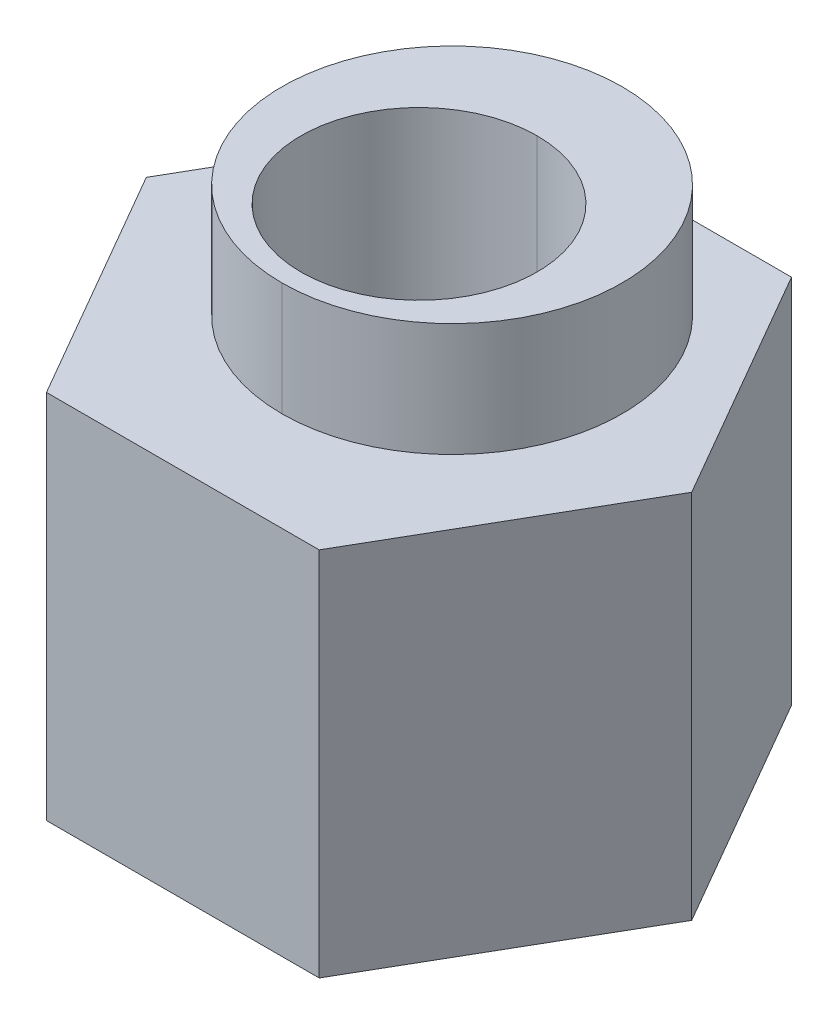
ISO-10303-21;
HEADER;
FILE_DESCRIPTION(('STEP AP214'),'2;1');
FILE_NAME('part.step','',(''),(''),'','','');
FILE_SCHEMA(('AUTOMOTIVE_DESIGN { 1 0 10303 214 1 1 1 1 }'));
ENDSEC;
DATA;
#1=APPLICATION_CONTEXT('core data for automotive mechanical design processes');
#2=APPLICATION_PROTOCOL_DEFINITION('international standard','automotive_design',2000,#1);
#3=PRODUCT_CONTEXT('',#1,'mechanical');
#4=PRODUCT('Part','Part','',(#3));
#5=PRODUCT_RELATED_PRODUCT_CATEGORY('part','',(#4));
#6=PRODUCT_DEFINITION_FORMATION('','',#4);
#7=PRODUCT_DEFINITION_CONTEXT('part definition',#1,'design');
#8=PRODUCT_DEFINITION('design','',#6,#7);
#9=PRODUCT_DEFINITION_SHAPE('','',#8);
#10=(LENGTH_UNIT() NAMED_UNIT(*) SI_UNIT(.MILLI.,.METRE.));
#11=(NAMED_UNIT(*) PLANE_ANGLE_UNIT() SI_UNIT($,.RADIAN.));
#12=(NAMED_UNIT(*) SI_UNIT($,.STERADIAN.) SOLID_ANGLE_UNIT());
#13=UNCERTAINTY_MEASURE_WITH_UNIT(LENGTH_MEASURE(1.E-05),#10,'distance_accuracy_value','');
#14=(GEOMETRIC_REPRESENTATION_CONTEXT(3) GLOBAL_UNCERTAINTY_ASSIGNED_CONTEXT((#13)) GLOBAL_UNIT_ASSIGNED_CONTEXT((#10,
#11,#12)) REPRESENTATION_CONTEXT('',''));
#15=CARTESIAN_POINT('',(0.,0.,0.));
#16=DIRECTION('',(0.,0.,1.));
#17=DIRECTION('',(1.,0.,0.));
#18=AXIS2_PLACEMENT_3D('',#15,#16,#17);
#19=CARTESIAN_POINT('',(0.,-0.5,0.));
#20=DIRECTION('',(0.,1.,0.));
#21=DIRECTION('',(0.,0.,1.));
#22=AXIS2_PLACEMENT_3D('',#19,#20,#21);
#23=CONICAL_SURFACE('',#22,3.5,0.785398163397448);
#24=DIRECTION('',(0.,0.707106781186548,-0.707106781186548));
#25=VECTOR('',#24,1.);
#26=CARTESIAN_POINT('',(0.,-0.5,-3.5));
#27=LINE('',#26,#25);
#28=CARTESIAN_POINT('',(0.,-0.5,-3.5));
#29=VERTEX_POINT('',#28);
#30=CARTESIAN_POINT('',(0.,-0.4,-3.6));
#31=VERTEX_POINT('',#30);
#32=EDGE_CURVE('E272',#29,#31,#27,.T.);
#33=ORIENTED_EDGE('',*,*,#32,.F.);
#34=CARTESIAN_POINT('',(0.,-0.5,0.));
#35=DIRECTION('',(0.,-1.,0.));
#36=DIRECTION('',(0.,0.,-1.));
#37=AXIS2_PLACEMENT_3D('',#34,#35,#36);
#38=CIRCLE('',#37,3.5);
#39=CARTESIAN_POINT('',(0.,-0.5,3.5));
#40=VERTEX_POINT('',#39);
#41=EDGE_CURVE('E235',#40,#29,#38,.T.);
#42=ORIENTED_EDGE('',*,*,#41,.F.);
#43=DIRECTION('',(0.,0.707106781186548,0.707106781186548));
#44=VECTOR('',#43,1.);
#45=CARTESIAN_POINT('',(0.,-0.5,3.5));
#46=LINE('',#45,#44);
#47=CARTESIAN_POINT('',(0.,-0.4,3.6));
#48=VERTEX_POINT('',#47);
#49=EDGE_CURVE('E287',#40,#48,#46,.T.);
#50=ORIENTED_EDGE('',*,*,#49,.T.);
#51=CARTESIAN_POINT('',(0.,-0.4,0.));
#52=DIRECTION('',(0.,1.,0.));
#53=DIRECTION('',(0.,0.,-1.));
#54=AXIS2_PLACEMENT_3D('',#51,#52,#53);
#55=CIRCLE('',#54,3.6);
#56=EDGE_CURVE('E254',#31,#48,#55,.T.);
#57=ORIENTED_EDGE('',*,*,#56,.F.);
#58=EDGE_LOOP('',(#33,#42,#50,#57));
#59=FACE_BOUND('',#58,.T.);
#60=ADVANCED_FACE('F17',(#59),#23,.T.);
#61=CARTESIAN_POINT('',(0.,10.25,0.));
#62=DIRECTION('',(0.,-1.,0.));
#63=DIRECTION('',(0.,0.,-1.));
#64=AXIS2_PLACEMENT_3D('',#61,#62,#63);
#65=CYLINDRICAL_SURFACE('',#64,2.5);
#66=DIRECTION('',(0.,-1.,0.));
#67=VECTOR('',#66,1.);
#68=CARTESIAN_POINT('',(0.,10.25,2.5));
#69=LINE('',#68,#67);
#70=CARTESIAN_POINT('',(0.,10.25,2.5));
#71=VERTEX_POINT('',#70);
#72=CARTESIAN_POINT('',(0.,-0.5,2.5));
#73=VERTEX_POINT('',#72);
#74=EDGE_CURVE('E283',#71,#73,#69,.T.);
#75=ORIENTED_EDGE('',*,*,#74,.F.);
#76=CARTESIAN_POINT('',(0.,10.25,0.));
#77=DIRECTION('',(0.,-1.,0.));
#78=DIRECTION('',(0.,0.,-1.));
#79=AXIS2_PLACEMENT_3D('',#76,#77,#78);
#80=CIRCLE('',#79,2.5);
#81=CARTESIAN_POINT('',(0.,10.25,-2.5));
#82=VERTEX_POINT('',#81);
#83=EDGE_CURVE('E11',#82,#71,#80,.T.);
#84=ORIENTED_EDGE('',*,*,#83,.F.);
#85=DIRECTION('',(0.,-1.,0.));
#86=VECTOR('',#85,1.);
#87=CARTESIAN_POINT('',(0.,10.25,-2.5));
#88=LINE('',#87,#86);
#89=CARTESIAN_POINT('',(0.,-0.5,-2.5));
#90=VERTEX_POINT('',#89);
#91=EDGE_CURVE('E282',#82,#90,#88,.T.);
#92=ORIENTED_EDGE('',*,*,#91,.T.);
#93=CARTESIAN_POINT('',(0.,-0.5,0.));
#94=DIRECTION('',(0.,-1.,0.));
#95=DIRECTION('',(0.,0.,-1.));
#96=AXIS2_PLACEMENT_3D('',#93,#94,#95);
#97=CIRCLE('',#96,2.5);
#98=EDGE_CURVE('E222',#90,#73,#97,.T.);
#99=ORIENTED_EDGE('',*,*,#98,.T.);
#100=EDGE_LOOP('',(#75,#84,#92,#99));
#101=FACE_BOUND('',#100,.T.);
#102=ADVANCED_FACE('F309',(#101),#65,.F.);
#103=CARTESIAN_POINT('',(0.,10.25,-0.7));
#104=DIRECTION('',(0.,1.,0.));
#105=DIRECTION('',(1.,0.,0.));
#106=AXIS2_PLACEMENT_3D('',#103,#104,#105);
#107=PLANE('',#106);
#108=ORIENTED_EDGE('',*,*,#83,.T.);
#109=CARTESIAN_POINT('',(0.,10.25,0.));
#110=DIRECTION('',(0.,-1.,0.));
#111=DIRECTION('',(0.,0.,-1.));
#112=AXIS2_PLACEMENT_3D('',#109,#110,#111);
#113=CIRCLE('',#112,2.5);
#114=EDGE_CURVE('E291',#71,#82,#113,.T.);
#115=ORIENTED_EDGE('',*,*,#114,.T.);
#116=EDGE_LOOP('',(#108,#115));
#117=FACE_BOUND('',#116,.T.);
#118=CARTESIAN_POINT('',(0.,10.25,-0.7));
#119=DIRECTION('',(0.,1.,0.));
#120=DIRECTION('',(0.,0.,1.));
#121=AXIS2_PLACEMENT_3D('',#118,#119,#120);
#122=CIRCLE('',#121,3.6);
#123=CARTESIAN_POINT('',(0.,10.25,-4.3));
#124=VERTEX_POINT('',#123);
#125=CARTESIAN_POINT('',(0.,10.25,2.9));
#126=VERTEX_POINT('',#125);
#127=EDGE_CURVE('E25',#124,#126,#122,.T.);
#128=ORIENTED_EDGE('',*,*,#127,.T.);
#129=CARTESIAN_POINT('',(0.,10.25,-0.7));
#130=DIRECTION('',(0.,1.,0.));
#131=DIRECTION('',(0.,0.,1.));
#132=AXIS2_PLACEMENT_3D('',#129,#130,#131);
#133=CIRCLE('',#132,3.6);
#134=EDGE_CURVE('E174',#126,#124,#133,.T.);
#135=ORIENTED_EDGE('',*,*,#134,.T.);
#136=EDGE_LOOP('',(#128,#135));
#137=FACE_BOUND('',#136,.T.);
#138=ADVANCED_FACE('F307',(#117,#137),#107,.T.);
#139=CARTESIAN_POINT('',(0.,10.25,-0.7));
#140=DIRECTION('',(0.,-1.,0.));
#141=DIRECTION('',(0.,0.,-1.));
#142=AXIS2_PLACEMENT_3D('',#139,#140,#141);
#143=CYLINDRICAL_SURFACE('',#142,3.6);
#144=DIRECTION('',(0.,-1.,0.));
#145=VECTOR('',#144,1.);
#146=CARTESIAN_POINT('',(0.,10.25,2.9));
#147=LINE('',#146,#145);
#148=CARTESIAN_POINT('',(0.,7.85,2.9));
#149=VERTEX_POINT('',#148);
#150=EDGE_CURVE('E167',#126,#149,#147,.T.);
#151=ORIENTED_EDGE('',*,*,#150,.F.);
#152=ORIENTED_EDGE('',*,*,#127,.F.);
#153=DIRECTION('',(0.,-1.,0.));
#154=VECTOR('',#153,1.);
#155=CARTESIAN_POINT('',(0.,10.25,-4.3));
#156=LINE('',#155,#154);
#157=CARTESIAN_POINT('',(0.,7.85,-4.3));
#158=VERTEX_POINT('',#157);
#159=EDGE_CURVE('E158',#124,#158,#156,.T.);
#160=ORIENTED_EDGE('',*,*,#159,.T.);
#161=CARTESIAN_POINT('',(0.,7.85,-0.7));
#162=DIRECTION('',(0.,1.,0.));
#163=DIRECTION('',(0.,0.,1.));
#164=AXIS2_PLACEMENT_3D('',#161,#162,#163);
#165=CIRCLE('',#164,3.6);
#166=EDGE_CURVE('E145',#158,#149,#165,.T.);
#167=ORIENTED_EDGE('',*,*,#166,.T.);
#168=EDGE_LOOP('',(#151,#152,#160,#167));
#169=FACE_BOUND('',#168,.T.);
#170=ADVANCED_FACE('F159',(#169),#143,.T.);
#171=CARTESIAN_POINT('',(0.,-0.5,0.));
#172=DIRECTION('',(0.,-1.,0.));
#173=DIRECTION('',(0.,0.,-1.));
#174=AXIS2_PLACEMENT_3D('',#171,#172,#173);
#175=PLANE('',#174);
#176=ORIENTED_EDGE('',*,*,#98,.F.);
#177=CARTESIAN_POINT('',(0.,-0.5,0.));
#178=DIRECTION('',(0.,-1.,0.));
#179=DIRECTION('',(0.,0.,-1.));
#180=AXIS2_PLACEMENT_3D('',#177,#178,#179);
#181=CIRCLE('',#180,2.5);
#182=EDGE_CURVE('E278',#73,#90,#181,.T.);
#183=ORIENTED_EDGE('',*,*,#182,.F.);
#184=EDGE_LOOP('',(#176,#183));
#185=FACE_BOUND('',#184,.T.);
#186=ORIENTED_EDGE('',*,*,#41,.T.);
#187=CARTESIAN_POINT('',(0.,-0.5,0.));
#188=DIRECTION('',(0.,-1.,0.));
#189=DIRECTION('',(0.,0.,-1.));
#190=AXIS2_PLACEMENT_3D('',#187,#188,#189);
#191=CIRCLE('',#190,3.5);
#192=EDGE_CURVE('E277',#29,#40,#191,.T.);
#193=ORIENTED_EDGE('',*,*,#192,.T.);
#194=EDGE_LOOP('',(#186,#193));
#195=FACE_BOUND('',#194,.T.);
#196=ADVANCED_FACE('F317',(#185,#195),#175,.T.);
#197=CARTESIAN_POINT('',(0.,-0.5,0.));
#198=DIRECTION('',(0.,1.,0.));
#199=DIRECTION('',(0.,0.,1.));
#200=AXIS2_PLACEMENT_3D('',#197,#198,#199);
#201=CYLINDRICAL_SURFACE('',#200,3.6);
#202=DIRECTION('',(0.,1.,0.));
#203=VECTOR('',#202,1.);
#204=CARTESIAN_POINT('',(0.,-0.5,-3.6));
#205=LINE('',#204,#203);
#206=CARTESIAN_POINT('',(0.,0.,-3.6));
#207=VERTEX_POINT('',#206);
#208=EDGE_CURVE('E164',#31,#207,#205,.T.);
#209=ORIENTED_EDGE('',*,*,#208,.F.);
#210=ORIENTED_EDGE('',*,*,#56,.T.);
#211=DIRECTION('',(0.,1.,0.));
#212=VECTOR('',#211,1.);
#213=CARTESIAN_POINT('',(0.,-0.5,3.6));
#214=LINE('',#213,#212);
#215=CARTESIAN_POINT('',(0.,0.,3.6));
#216=VERTEX_POINT('',#215);
#217=EDGE_CURVE('E178',#48,#216,#214,.T.);
#218=ORIENTED_EDGE('',*,*,#217,.T.);
#219=CARTESIAN_POINT('',(0.,0.,0.));
#220=DIRECTION('',(0.,-1.,0.));
#221=DIRECTION('',(0.,0.,-1.));
#222=AXIS2_PLACEMENT_3D('',#219,#220,#221);
#223=CIRCLE('',#222,3.6);
#224=EDGE_CURVE('E155',#216,#207,#223,.T.);
#225=ORIENTED_EDGE('',*,*,#224,.T.);
#226=EDGE_LOOP('',(#209,#210,#218,#225));
#227=FACE_BOUND('',#226,.T.);
#228=ADVANCED_FACE('F558',(#227),#201,.T.);
#229=CARTESIAN_POINT('',(0.,0.,0.));
#230=DIRECTION('',(0.,1.,0.));
#231=DIRECTION('',(1.,0.,0.));
#232=AXIS2_PLACEMENT_3D('',#229,#230,#231);
#233=PLANE('',#232);
#234=ORIENTED_EDGE('',*,*,#224,.F.);
#235=CARTESIAN_POINT('',(0.,0.,0.));
#236=DIRECTION('',(0.,-1.,0.));
#237=DIRECTION('',(0.,0.,-1.));
#238=AXIS2_PLACEMENT_3D('',#235,#236,#237);
#239=CIRCLE('',#238,3.6);
#240=EDGE_CURVE('E186',#207,#216,#239,.T.);
#241=ORIENTED_EDGE('',*,*,#240,.F.);
#242=EDGE_LOOP('',(#234,#241));
#243=FACE_BOUND('',#242,.T.);
#244=DIRECTION('',(-0.5,0.,0.866025403784439));
#245=VECTOR('',#244,1.);
#246=CARTESIAN_POINT('',(-2.88675134594813,0.,-5.));
#247=LINE('',#246,#245);
#248=CARTESIAN_POINT('',(-2.88675134594813,0.,-5.));
#249=VERTEX_POINT('',#248);
#250=CARTESIAN_POINT('',(-5.77350269189626,0.,0.));
#251=VERTEX_POINT('',#250);
#252=EDGE_CURVE('E195',#249,#251,#247,.T.);
#253=ORIENTED_EDGE('',*,*,#252,.F.);
#254=DIRECTION('',(-1.,0.,0.));
#255=VECTOR('',#254,1.);
#256=CARTESIAN_POINT('',(2.88675134594813,0.,-5.));
#257=LINE('',#256,#255);
#258=CARTESIAN_POINT('',(2.88675134594813,0.,-5.));
#259=VERTEX_POINT('',#258);
#260=EDGE_CURVE('E49',#259,#249,#257,.T.);
#261=ORIENTED_EDGE('',*,*,#260,.F.);
#262=DIRECTION('',(-0.5,0.,-0.866025403784439));
#263=VECTOR('',#262,1.);
#264=CARTESIAN_POINT('',(5.77350269189626,0.,0.));
#265=LINE('',#264,#263);
#266=CARTESIAN_POINT('',(5.77350269189626,0.,0.));
#267=VERTEX_POINT('',#266);
#268=EDGE_CURVE('E239',#267,#259,#265,.T.);
#269=ORIENTED_EDGE('',*,*,#268,.F.);
#270=DIRECTION('',(0.5,0.,-0.866025403784439));
#271=VECTOR('',#270,1.);
#272=CARTESIAN_POINT('',(2.88675134594813,0.,5.));
#273=LINE('',#272,#271);
#274=CARTESIAN_POINT('',(2.88675134594813,0.,5.));
#275=VERTEX_POINT('',#274);
#276=EDGE_CURVE('E180',#275,#267,#273,.T.);
#277=ORIENTED_EDGE('',*,*,#276,.F.);
#278=DIRECTION('',(1.,0.,0.));
#279=VECTOR('',#278,1.);
#280=CARTESIAN_POINT('',(-2.88675134594813,0.,5.));
#281=LINE('',#280,#279);
#282=CARTESIAN_POINT('',(-2.88675134594813,0.,5.));
#283=VERTEX_POINT('',#282);
#284=EDGE_CURVE('E215',#283,#275,#281,.T.);
#285=ORIENTED_EDGE('',*,*,#284,.F.);
#286=DIRECTION('',(0.5,0.,0.866025403784439));
#287=VECTOR('',#286,1.);
#288=CARTESIAN_POINT('',(-5.77350269189626,0.,0.));
#289=LINE('',#288,#287);
#290=EDGE_CURVE('E203',#251,#283,#289,.T.);
#291=ORIENTED_EDGE('',*,*,#290,.F.);
#292=EDGE_LOOP('',(#253,#261,#269,#277,#285,#291));
#293=FACE_BOUND('',#292,.T.);
#294=ADVANCED_FACE('F554',(#243,#293),#233,.F.);
#295=CARTESIAN_POINT('',(0.,7.85,0.));
#296=DIRECTION('',(0.,1.,0.));
#297=DIRECTION('',(1.,0.,0.));
#298=AXIS2_PLACEMENT_3D('',#295,#296,#297);
#299=PLANE('',#298);
#300=ORIENTED_EDGE('',*,*,#166,.F.);
#301=CARTESIAN_POINT('',(0.,7.85,-0.7));
#302=DIRECTION('',(0.,1.,0.));
#303=DIRECTION('',(0.,0.,1.));
#304=AXIS2_PLACEMENT_3D('',#301,#302,#303);
#305=CIRCLE('',#304,3.6);
#306=EDGE_CURVE('E150',#149,#158,#305,.T.);
#307=ORIENTED_EDGE('',*,*,#306,.F.);
#308=EDGE_LOOP('',(#300,#307));
#309=FACE_BOUND('',#308,.T.);
#310=DIRECTION('',(-0.5,0.,0.866025403784439));
#311=VECTOR('',#310,1.);
#312=CARTESIAN_POINT('',(-2.88675134594813,7.85,-5.));
#313=LINE('',#312,#311);
#314=CARTESIAN_POINT('',(-2.88675134594813,7.85,-5.));
#315=VERTEX_POINT('',#314);
#316=CARTESIAN_POINT('',(-5.77350269189626,7.85,0.));
#317=VERTEX_POINT('',#316);
#318=EDGE_CURVE('E194',#315,#317,#313,.T.);
#319=ORIENTED_EDGE('',*,*,#318,.T.);
#320=DIRECTION('',(0.5,0.,0.866025403784439));
#321=VECTOR('',#320,1.);
#322=CARTESIAN_POINT('',(-5.77350269189626,7.85,0.));
#323=LINE('',#322,#321);
#324=CARTESIAN_POINT('',(-2.88675134594813,7.85,5.));
#325=VERTEX_POINT('',#324);
#326=EDGE_CURVE('E211',#317,#325,#323,.T.);
#327=ORIENTED_EDGE('',*,*,#326,.T.);
#328=DIRECTION('',(1.,0.,0.));
#329=VECTOR('',#328,1.);
#330=CARTESIAN_POINT('',(-2.88675134594813,7.85,5.));
#331=LINE('',#330,#329);
#332=CARTESIAN_POINT('',(2.88675134594813,7.85,5.));
#333=VERTEX_POINT('',#332);
#334=EDGE_CURVE('E184',#325,#333,#331,.T.);
#335=ORIENTED_EDGE('',*,*,#334,.T.);
#336=DIRECTION('',(0.5,0.,-0.866025403784439));
#337=VECTOR('',#336,1.);
#338=CARTESIAN_POINT('',(2.88675134594813,7.85,5.));
#339=LINE('',#338,#337);
#340=CARTESIAN_POINT('',(5.77350269189626,7.85,0.));
#341=VERTEX_POINT('',#340);
#342=EDGE_CURVE('E232',#333,#341,#339,.T.);
#343=ORIENTED_EDGE('',*,*,#342,.T.);
#344=DIRECTION('',(-0.5,0.,-0.866025403784439));
#345=VECTOR('',#344,1.);
#346=CARTESIAN_POINT('',(5.77350269189626,7.85,0.));
#347=LINE('',#346,#345);
#348=CARTESIAN_POINT('',(2.88675134594813,7.85,-5.));
#349=VERTEX_POINT('',#348);
#350=EDGE_CURVE('E246',#341,#349,#347,.T.);
#351=ORIENTED_EDGE('',*,*,#350,.T.);
#352=DIRECTION('',(-1.,0.,0.));
#353=VECTOR('',#352,1.);
#354=CARTESIAN_POINT('',(2.88675134594813,7.85,-5.));
#355=LINE('',#354,#353);
#356=EDGE_CURVE('E38',#349,#315,#355,.T.);
#357=ORIENTED_EDGE('',*,*,#356,.T.);
#358=EDGE_LOOP('',(#319,#327,#335,#343,#351,#357));
#359=FACE_BOUND('',#358,.T.);
#360=ADVANCED_FACE('F147',(#309,#359),#299,.T.);
#361=CARTESIAN_POINT('',(2.88675134594813,7.85,-5.));
#362=DIRECTION('',(0.,0.,1.));
#363=DIRECTION('',(1.,0.,0.));
#364=AXIS2_PLACEMENT_3D('',#361,#362,#363);
#365=PLANE('',#364);
#366=ORIENTED_EDGE('',*,*,#260,.T.);
#367=DIRECTION('',(0.,-1.,0.));
#368=VECTOR('',#367,1.);
#369=CARTESIAN_POINT('',(-2.88675134594813,7.85,-5.));
#370=LINE('',#369,#368);
#371=EDGE_CURVE('E199',#315,#249,#370,.T.);
#372=ORIENTED_EDGE('',*,*,#371,.F.);
#373=ORIENTED_EDGE('',*,*,#356,.F.);
#374=DIRECTION('',(0.,-1.,0.));
#375=VECTOR('',#374,1.);
#376=CARTESIAN_POINT('',(2.88675134594813,7.85,-5.));
#377=LINE('',#376,#375);
#378=EDGE_CURVE('E243',#349,#259,#377,.T.);
#379=ORIENTED_EDGE('',*,*,#378,.T.);
#380=EDGE_LOOP('',(#366,#372,#373,#379));
#381=FACE_BOUND('',#380,.T.);
#382=ADVANCED_FACE('F573',(#381),#365,.F.);
#383=CARTESIAN_POINT('',(5.77350269189626,7.85,0.));
#384=DIRECTION('',(-0.866025403784439,0.,0.5));
#385=DIRECTION('',(0.,1.,0.));
#386=AXIS2_PLACEMENT_3D('',#383,#384,#385);
#387=PLANE('',#386);
#388=ORIENTED_EDGE('',*,*,#268,.T.);
#389=ORIENTED_EDGE('',*,*,#378,.F.);
#390=ORIENTED_EDGE('',*,*,#350,.F.);
#391=DIRECTION('',(0.,-1.,0.));
#392=VECTOR('',#391,1.);
#393=CARTESIAN_POINT('',(5.77350269189626,7.85,0.));
#394=LINE('',#393,#392);
#395=EDGE_CURVE('E183',#341,#267,#394,.T.);
#396=ORIENTED_EDGE('',*,*,#395,.T.);
#397=EDGE_LOOP('',(#388,#389,#390,#396));
#398=FACE_BOUND('',#397,.T.);
#399=ADVANCED_FACE('F567',(#398),#387,.F.);
#400=CARTESIAN_POINT('',(2.88675134594813,7.85,5.));
#401=DIRECTION('',(-0.866025403784439,0.,-0.5));
#402=DIRECTION('',(-0.5,0.,0.866025403784439));
#403=AXIS2_PLACEMENT_3D('',#400,#401,#402);
#404=PLANE('',#403);
#405=ORIENTED_EDGE('',*,*,#276,.T.);
#406=ORIENTED_EDGE('',*,*,#395,.F.);
#407=ORIENTED_EDGE('',*,*,#342,.F.);
#408=DIRECTION('',(0.,-1.,0.));
#409=VECTOR('',#408,1.);
#410=CARTESIAN_POINT('',(2.88675134594813,7.85,5.));
#411=LINE('',#410,#409);
#412=EDGE_CURVE('E219',#333,#275,#411,.T.);
#413=ORIENTED_EDGE('',*,*,#412,.T.);
#414=EDGE_LOOP('',(#405,#406,#407,#413));
#415=FACE_BOUND('',#414,.T.);
#416=ADVANCED_FACE('F499',(#415),#404,.F.);
#417=CARTESIAN_POINT('',(-2.88675134594813,7.85,5.));
#418=DIRECTION('',(0.,0.,-1.));
#419=DIRECTION('',(-1.,0.,0.));
#420=AXIS2_PLACEMENT_3D('',#417,#418,#419);
#421=PLANE('',#420);
#422=ORIENTED_EDGE('',*,*,#284,.T.);
#423=ORIENTED_EDGE('',*,*,#412,.F.);
#424=ORIENTED_EDGE('',*,*,#334,.F.);
#425=DIRECTION('',(0.,-1.,0.));
#426=VECTOR('',#425,1.);
#427=CARTESIAN_POINT('',(-2.88675134594813,7.85,5.));
#428=LINE('',#427,#426);
#429=EDGE_CURVE('E207',#325,#283,#428,.T.);
#430=ORIENTED_EDGE('',*,*,#429,.T.);
#431=EDGE_LOOP('',(#422,#423,#424,#430));
#432=FACE_BOUND('',#431,.T.);
#433=ADVANCED_FACE('F494',(#432),#421,.F.);
#434=CARTESIAN_POINT('',(-5.77350269189626,7.85,0.));
#435=DIRECTION('',(0.866025403784439,0.,-0.5));
#436=DIRECTION('',(0.,-1.,0.));
#437=AXIS2_PLACEMENT_3D('',#434,#435,#436);
#438=PLANE('',#437);
#439=ORIENTED_EDGE('',*,*,#290,.T.);
#440=ORIENTED_EDGE('',*,*,#429,.F.);
#441=ORIENTED_EDGE('',*,*,#326,.F.);
#442=DIRECTION('',(0.,-1.,0.));
#443=VECTOR('',#442,1.);
#444=CARTESIAN_POINT('',(-5.77350269189626,7.85,0.));
#445=LINE('',#444,#443);
#446=EDGE_CURVE('E190',#317,#251,#445,.T.);
#447=ORIENTED_EDGE('',*,*,#446,.T.);
#448=EDGE_LOOP('',(#439,#440,#441,#447));
#449=FACE_BOUND('',#448,.T.);
#450=ADVANCED_FACE('F498',(#449),#438,.F.);
#451=CARTESIAN_POINT('',(-2.88675134594813,7.85,-5.));
#452=DIRECTION('',(0.866025403784439,0.,0.5));
#453=DIRECTION('',(0.,-1.,0.));
#454=AXIS2_PLACEMENT_3D('',#451,#452,#453);
#455=PLANE('',#454);
#456=ORIENTED_EDGE('',*,*,#252,.T.);
#457=ORIENTED_EDGE('',*,*,#446,.F.);
#458=ORIENTED_EDGE('',*,*,#318,.F.);
#459=ORIENTED_EDGE('',*,*,#371,.T.);
#460=EDGE_LOOP('',(#456,#457,#458,#459));
#461=FACE_BOUND('',#460,.T.);
#462=ADVANCED_FACE('F516',(#461),#455,.F.);
#463=CARTESIAN_POINT('',(0.,-0.5,0.));
#464=DIRECTION('',(0.,1.,0.));
#465=DIRECTION('',(0.,0.,1.));
#466=AXIS2_PLACEMENT_3D('',#463,#464,#465);
#467=CYLINDRICAL_SURFACE('',#466,3.6);
#468=CARTESIAN_POINT('',(0.,-0.4,0.));
#469=DIRECTION('',(0.,1.,0.));
#470=DIRECTION('',(0.,0.,-1.));
#471=AXIS2_PLACEMENT_3D('',#468,#469,#470);
#472=CIRCLE('',#471,3.6);
#473=EDGE_CURVE('E276',#48,#31,#472,.T.);
#474=ORIENTED_EDGE('',*,*,#473,.T.);
#475=ORIENTED_EDGE('',*,*,#208,.T.);
#476=ORIENTED_EDGE('',*,*,#240,.T.);
#477=ORIENTED_EDGE('',*,*,#217,.F.);
#478=EDGE_LOOP('',(#474,#475,#476,#477));
#479=FACE_BOUND('',#478,.T.);
#480=ADVANCED_FACE('F525',(#479),#467,.T.);
#481=CARTESIAN_POINT('',(0.,10.25,-0.7));
#482=DIRECTION('',(0.,-1.,0.));
#483=DIRECTION('',(0.,0.,-1.));
#484=AXIS2_PLACEMENT_3D('',#481,#482,#483);
#485=CYLINDRICAL_SURFACE('',#484,3.6);
#486=ORIENTED_EDGE('',*,*,#134,.F.);
#487=ORIENTED_EDGE('',*,*,#150,.T.);
#488=ORIENTED_EDGE('',*,*,#306,.T.);
#489=ORIENTED_EDGE('',*,*,#159,.F.);
#490=EDGE_LOOP('',(#486,#487,#488,#489));
#491=FACE_BOUND('',#490,.T.);
#492=ADVANCED_FACE('F166',(#491),#485,.T.);
#493=CARTESIAN_POINT('',(0.,10.25,0.));
#494=DIRECTION('',(0.,-1.,0.));
#495=DIRECTION('',(0.,0.,-1.));
#496=AXIS2_PLACEMENT_3D('',#493,#494,#495);
#497=CYLINDRICAL_SURFACE('',#496,2.5);
#498=ORIENTED_EDGE('',*,*,#114,.F.);
#499=ORIENTED_EDGE('',*,*,#74,.T.);
#500=ORIENTED_EDGE('',*,*,#182,.T.);
#501=ORIENTED_EDGE('',*,*,#91,.F.);
#502=EDGE_LOOP('',(#498,#499,#500,#501));
#503=FACE_BOUND('',#502,.T.);
#504=ADVANCED_FACE('F508',(#503),#497,.F.);
#505=CARTESIAN_POINT('',(0.,-0.5,0.));
#506=DIRECTION('',(0.,1.,0.));
#507=DIRECTION('',(0.,0.,1.));
#508=AXIS2_PLACEMENT_3D('',#505,#506,#507);
#509=CONICAL_SURFACE('',#508,3.5,0.785398163397448);
#510=ORIENTED_EDGE('',*,*,#192,.F.);
#511=ORIENTED_EDGE('',*,*,#32,.T.);
#512=ORIENTED_EDGE('',*,*,#473,.F.);
#513=ORIENTED_EDGE('',*,*,#49,.F.);
#514=EDGE_LOOP('',(#510,#511,#512,#513));
#515=FACE_BOUND('',#514,.T.);
#516=ADVANCED_FACE('F329',(#515),#509,.T.);
#517=CLOSED_SHELL('',(#60,#102,#138,#170,#196,#228,#294,#360,#382,#399,#416,#433,#450,#462,#480,
#492,#504,#516));
#518=MANIFOLD_SOLID_BREP('B1',#517);
#519=ADVANCED_BREP_SHAPE_REPRESENTATION('',(#18,#518),#14);
#520=SHAPE_DEFINITION_REPRESENTATION(#9,#519);
ENDSEC;
END-ISO-10303-21;
